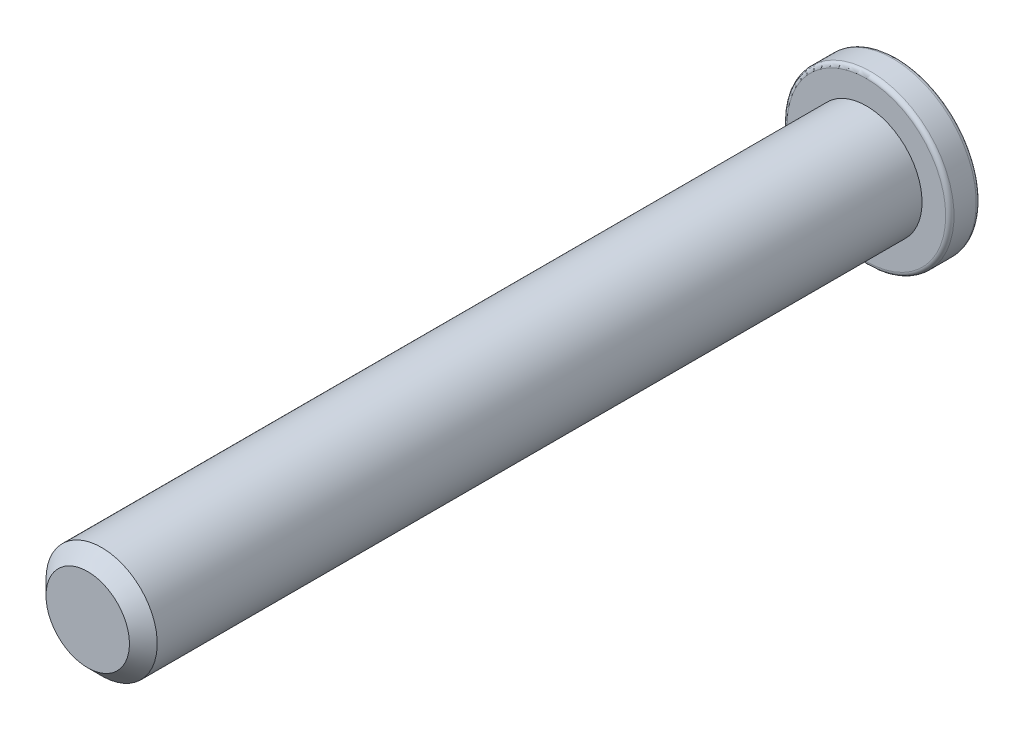
ISO-10303-21;
HEADER;
FILE_DESCRIPTION(('STEP AP214'),'2;1');
FILE_NAME('part.step','',(''),(''),'','','');
FILE_SCHEMA(('AUTOMOTIVE_DESIGN { 1 0 10303 214 1 1 1 1 }'));
ENDSEC;
DATA;
#1=APPLICATION_CONTEXT('core data for automotive mechanical design processes');
#2=APPLICATION_PROTOCOL_DEFINITION('international standard','automotive_design',2000,#1);
#3=PRODUCT_CONTEXT('',#1,'mechanical');
#4=PRODUCT('Part','Part','',(#3));
#5=PRODUCT_RELATED_PRODUCT_CATEGORY('part','',(#4));
#6=PRODUCT_DEFINITION_FORMATION('','',#4);
#7=PRODUCT_DEFINITION_CONTEXT('part definition',#1,'design');
#8=PRODUCT_DEFINITION('design','',#6,#7);
#9=PRODUCT_DEFINITION_SHAPE('','',#8);
#10=(LENGTH_UNIT() NAMED_UNIT(*) SI_UNIT(.MILLI.,.METRE.));
#11=(NAMED_UNIT(*) PLANE_ANGLE_UNIT() SI_UNIT($,.RADIAN.));
#12=(NAMED_UNIT(*) SI_UNIT($,.STERADIAN.) SOLID_ANGLE_UNIT());
#13=UNCERTAINTY_MEASURE_WITH_UNIT(LENGTH_MEASURE(1.E-05),#10,'distance_accuracy_value','');
#14=(GEOMETRIC_REPRESENTATION_CONTEXT(3) GLOBAL_UNCERTAINTY_ASSIGNED_CONTEXT((#13)) GLOBAL_UNIT_ASSIGNED_CONTEXT((#10,
#11,#12)) REPRESENTATION_CONTEXT('',''));
#15=CARTESIAN_POINT('',(0.,0.,0.));
#16=DIRECTION('',(0.,0.,1.));
#17=DIRECTION('',(1.,0.,0.));
#18=AXIS2_PLACEMENT_3D('',#15,#16,#17);
#19=CARTESIAN_POINT('',(12.09999928,-11.25,-18.9584026755113));
#20=DIRECTION('',(-0.923879532511287,0.,-0.38268343236509));
#21=DIRECTION('',(-0.38268343236509,0.,0.923879532511287));
#22=AXIS2_PLACEMENT_3D('',#19,#20,#21);
#23=PLANE('',#22);
#24=DIRECTION('',(0.,1.,0.));
#25=VECTOR('',#24,1.);
#26=CARTESIAN_POINT('',(11.6029430051523,-11.25,-17.7584026755113));
#27=LINE('',#26,#25);
#28=CARTESIAN_POINT('',(11.6029430051523,-11.3660878256678,-17.7584026755113));
#29=VERTEX_POINT('',#28);
#30=CARTESIAN_POINT('',(11.6029430051523,-11.1339121743322,-17.7584026755113));
#31=VERTEX_POINT('',#30);
#32=EDGE_CURVE('E117',#29,#31,#27,.T.);
#33=ORIENTED_EDGE('',*,*,#32,.T.);
#34=DIRECTION('',(-0.381887326256781,-0.0644695530821724,0.921957562347547));
#35=VECTOR('',#34,1.);
#36=CARTESIAN_POINT('',(12.09999928,-11.05,-18.9584026755113));
#37=LINE('',#36,#35);
#38=CARTESIAN_POINT('',(12.09999928,-11.05,-18.9584026755113));
#39=VERTEX_POINT('',#38);
#40=EDGE_CURVE('E133',#39,#31,#37,.T.);
#41=ORIENTED_EDGE('',*,*,#40,.F.);
#42=DIRECTION('',(0.,1.,0.));
#43=VECTOR('',#42,1.);
#44=CARTESIAN_POINT('',(12.09999928,-11.25,-18.9584026755113));
#45=LINE('',#44,#43);
#46=CARTESIAN_POINT('',(12.09999928,-11.45,-18.9584026755113));
#47=VERTEX_POINT('',#46);
#48=EDGE_CURVE('E122',#39,#47,#45,.F.);
#49=ORIENTED_EDGE('',*,*,#48,.T.);
#50=DIRECTION('',(0.381887326256781,-0.0644695530821737,-0.921957562347547));
#51=VECTOR('',#50,1.);
#52=CARTESIAN_POINT('',(11.6029430051523,-11.3660878256678,-17.7584026755113));
#53=LINE('',#52,#51);
#54=EDGE_CURVE('E286',#29,#47,#53,.T.);
#55=ORIENTED_EDGE('',*,*,#54,.F.);
#56=EDGE_LOOP('',(#33,#41,#49,#55));
#57=FACE_BOUND('',#56,.T.);
#58=ADVANCED_FACE('F17',(#57),#23,.T.);
#59=CARTESIAN_POINT('',(11.24999928,-11.05,-18.9584026755113));
#60=DIRECTION('',(0.,-0.997564050259824,-0.0697564737441253));
#61=DIRECTION('',(0.,0.0697564737441253,-0.997564050259824));
#62=AXIS2_PLACEMENT_3D('',#59,#60,#61);
#63=PLANE('',#62);
#64=DIRECTION('',(1.,0.,0.));
#65=VECTOR('',#64,1.);
#66=CARTESIAN_POINT('',(11.24999928,-11.1339121743322,-17.7584026755113));
#67=LINE('',#66,#65);
#68=CARTESIAN_POINT('',(11.3660871056678,-11.1339121743322,-17.7584026755113));
#69=VERTEX_POINT('',#68);
#70=EDGE_CURVE('E135',#31,#69,#67,.F.);
#71=ORIENTED_EDGE('',*,*,#70,.T.);
#72=DIRECTION('',(-0.0695873743166642,-0.0695873743166541,0.995145815783509));
#73=VECTOR('',#72,1.);
#74=CARTESIAN_POINT('',(11.44999928,-11.05,-18.9584026755113));
#75=LINE('',#74,#73);
#76=CARTESIAN_POINT('',(11.44999928,-11.05,-18.9584026755113));
#77=VERTEX_POINT('',#76);
#78=EDGE_CURVE('E139',#77,#69,#75,.T.);
#79=ORIENTED_EDGE('',*,*,#78,.F.);
#80=DIRECTION('',(1.,0.,0.));
#81=VECTOR('',#80,1.);
#82=CARTESIAN_POINT('',(11.24999928,-11.05,-18.9584026755113));
#83=LINE('',#82,#81);
#84=EDGE_CURVE('E126',#77,#39,#83,.T.);
#85=ORIENTED_EDGE('',*,*,#84,.T.);
#86=ORIENTED_EDGE('',*,*,#40,.T.);
#87=EDGE_LOOP('',(#71,#79,#85,#86));
#88=FACE_BOUND('',#87,.T.);
#89=ADVANCED_FACE('F137',(#88),#63,.T.);
#90=CARTESIAN_POINT('',(11.24999928,-11.45,-18.9584026755113));
#91=DIRECTION('',(0.,0.997564050259824,-0.0697564737441253));
#92=DIRECTION('',(0.,0.0697564737441253,0.997564050259824));
#93=AXIS2_PLACEMENT_3D('',#90,#91,#92);
#94=PLANE('',#93);
#95=DIRECTION('',(1.,0.,0.));
#96=VECTOR('',#95,1.);
#97=CARTESIAN_POINT('',(11.24999928,-11.3660878256678,-17.7584026755113));
#98=LINE('',#97,#96);
#99=CARTESIAN_POINT('',(11.3660871056678,-11.3660878256678,-17.7584026755113));
#100=VERTEX_POINT('',#99);
#101=EDGE_CURVE('E288',#100,#29,#98,.T.);
#102=ORIENTED_EDGE('',*,*,#101,.T.);
#103=ORIENTED_EDGE('',*,*,#54,.T.);
#104=DIRECTION('',(1.,0.,0.));
#105=VECTOR('',#104,1.);
#106=CARTESIAN_POINT('',(11.24999928,-11.45,-18.9584026755113));
#107=LINE('',#106,#105);
#108=CARTESIAN_POINT('',(11.44999928,-11.45,-18.9584026755113));
#109=VERTEX_POINT('',#108);
#110=EDGE_CURVE('E129',#47,#109,#107,.F.);
#111=ORIENTED_EDGE('',*,*,#110,.T.);
#112=DIRECTION('',(0.0695873743166642,-0.0695873743166541,-0.995145815783509));
#113=VECTOR('',#112,1.);
#114=CARTESIAN_POINT('',(11.3660871056678,-11.3660878256678,-17.7584026755113));
#115=LINE('',#114,#113);
#116=EDGE_CURVE('E272',#100,#109,#115,.T.);
#117=ORIENTED_EDGE('',*,*,#116,.F.);
#118=EDGE_LOOP('',(#102,#103,#111,#117));
#119=FACE_BOUND('',#118,.T.);
#120=ADVANCED_FACE('F459',(#119),#94,.T.);
#121=CARTESIAN_POINT('',(11.44999928,-11.25,-18.9584026755113));
#122=DIRECTION('',(-0.997564050259824,0.,-0.0697564737441253));
#123=DIRECTION('',(-0.0697564737441253,0.,0.997564050259824));
#124=AXIS2_PLACEMENT_3D('',#121,#122,#123);
#125=PLANE('',#124);
#126=DIRECTION('',(0.,1.,0.));
#127=VECTOR('',#126,1.);
#128=CARTESIAN_POINT('',(11.3660871056678,-11.25,-17.7584026755113));
#129=LINE('',#128,#127);
#130=CARTESIAN_POINT('',(11.3660871056678,-10.8970562748477,-17.7584026755113));
#131=VERTEX_POINT('',#130);
#132=EDGE_CURVE('E281',#69,#131,#129,.T.);
#133=ORIENTED_EDGE('',*,*,#132,.T.);
#134=DIRECTION('',(-0.0644695530821645,-0.381887326256792,0.921957562347544));
#135=VECTOR('',#134,1.);
#136=CARTESIAN_POINT('',(11.44999928,-10.4,-18.9584026755113));
#137=LINE('',#136,#135);
#138=CARTESIAN_POINT('',(11.44999928,-10.4,-18.9584026755113));
#139=VERTEX_POINT('',#138);
#140=EDGE_CURVE('E266',#139,#131,#137,.T.);
#141=ORIENTED_EDGE('',*,*,#140,.F.);
#142=DIRECTION('',(0.,1.,0.));
#143=VECTOR('',#142,1.);
#144=CARTESIAN_POINT('',(11.44999928,-11.25,-18.9584026755113));
#145=LINE('',#144,#143);
#146=EDGE_CURVE('E284',#139,#77,#145,.F.);
#147=ORIENTED_EDGE('',*,*,#146,.T.);
#148=ORIENTED_EDGE('',*,*,#78,.T.);
#149=EDGE_LOOP('',(#133,#141,#147,#148));
#150=FACE_BOUND('',#149,.T.);
#151=ADVANCED_FACE('F298',(#150),#125,.T.);
#152=CARTESIAN_POINT('',(11.44999928,-11.25,-18.9584026755113));
#153=DIRECTION('',(-0.997564050259824,0.,-0.0697564737441253));
#154=DIRECTION('',(-0.0697564737441253,0.,0.997564050259824));
#155=AXIS2_PLACEMENT_3D('',#152,#153,#154);
#156=PLANE('',#155);
#157=DIRECTION('',(0.,1.,0.));
#158=VECTOR('',#157,1.);
#159=CARTESIAN_POINT('',(11.3660871056678,-11.25,-17.7584026755113));
#160=LINE('',#159,#158);
#161=CARTESIAN_POINT('',(11.3660871056678,-11.6029437251523,-17.7584026755113));
#162=VERTEX_POINT('',#161);
#163=EDGE_CURVE('E275',#162,#100,#160,.T.);
#164=ORIENTED_EDGE('',*,*,#163,.T.);
#165=ORIENTED_EDGE('',*,*,#116,.T.);
#166=DIRECTION('',(0.,1.,0.));
#167=VECTOR('',#166,1.);
#168=CARTESIAN_POINT('',(11.44999928,-11.25,-18.9584026755113));
#169=LINE('',#168,#167);
#170=CARTESIAN_POINT('',(11.44999928,-12.1,-18.9584026755113));
#171=VERTEX_POINT('',#170);
#172=EDGE_CURVE('E278',#109,#171,#169,.F.);
#173=ORIENTED_EDGE('',*,*,#172,.T.);
#174=DIRECTION('',(0.0644695530821645,-0.381887326256792,-0.921957562347544));
#175=VECTOR('',#174,1.);
#176=CARTESIAN_POINT('',(11.3660871056678,-11.6029437251523,-17.7584026755113));
#177=LINE('',#176,#175);
#178=EDGE_CURVE('E255',#162,#171,#177,.T.);
#179=ORIENTED_EDGE('',*,*,#178,.F.);
#180=EDGE_LOOP('',(#164,#165,#173,#179));
#181=FACE_BOUND('',#180,.T.);
#182=ADVANCED_FACE('F445',(#181),#156,.T.);
#183=CARTESIAN_POINT('',(11.24999928,-10.4,-18.9584026755113));
#184=DIRECTION('',(0.,-0.923879532511287,-0.38268343236509));
#185=DIRECTION('',(0.,0.38268343236509,-0.923879532511287));
#186=AXIS2_PLACEMENT_3D('',#183,#184,#185);
#187=PLANE('',#186);
#188=DIRECTION('',(1.,0.,0.));
#189=VECTOR('',#188,1.);
#190=CARTESIAN_POINT('',(11.24999928,-10.8970562748477,-17.7584026755113));
#191=LINE('',#190,#189);
#192=CARTESIAN_POINT('',(11.1339114543322,-10.8970562748477,-17.7584026755113));
#193=VERTEX_POINT('',#192);
#194=EDGE_CURVE('E264',#131,#193,#191,.F.);
#195=ORIENTED_EDGE('',*,*,#194,.T.);
#196=DIRECTION('',(0.0644695530821724,-0.381887326256779,0.921957562347548));
#197=VECTOR('',#196,1.);
#198=CARTESIAN_POINT('',(11.04999928,-10.4,-18.9584026755113));
#199=LINE('',#198,#197);
#200=CARTESIAN_POINT('',(11.04999928,-10.4,-18.9584026755113));
#201=VERTEX_POINT('',#200);
#202=EDGE_CURVE('E249',#201,#193,#199,.T.);
#203=ORIENTED_EDGE('',*,*,#202,.F.);
#204=DIRECTION('',(1.,0.,0.));
#205=VECTOR('',#204,1.);
#206=CARTESIAN_POINT('',(11.24999928,-10.4,-18.9584026755113));
#207=LINE('',#206,#205);
#208=EDGE_CURVE('E269',#201,#139,#207,.T.);
#209=ORIENTED_EDGE('',*,*,#208,.T.);
#210=ORIENTED_EDGE('',*,*,#140,.T.);
#211=EDGE_LOOP('',(#195,#203,#209,#210));
#212=FACE_BOUND('',#211,.T.);
#213=ADVANCED_FACE('F302',(#212),#187,.T.);
#214=CARTESIAN_POINT('',(11.24999928,-12.1,-18.9584026755113));
#215=DIRECTION('',(0.,0.923879532511287,-0.38268343236509));
#216=DIRECTION('',(0.,0.38268343236509,0.923879532511287));
#217=AXIS2_PLACEMENT_3D('',#214,#215,#216);
#218=PLANE('',#217);
#219=DIRECTION('',(1.,0.,0.));
#220=VECTOR('',#219,1.);
#221=CARTESIAN_POINT('',(11.24999928,-11.6029437251523,-17.7584026755113));
#222=LINE('',#221,#220);
#223=CARTESIAN_POINT('',(11.1339114543322,-11.6029437251523,-17.7584026755113));
#224=VERTEX_POINT('',#223);
#225=EDGE_CURVE('E258',#224,#162,#222,.T.);
#226=ORIENTED_EDGE('',*,*,#225,.T.);
#227=ORIENTED_EDGE('',*,*,#178,.T.);
#228=DIRECTION('',(1.,0.,0.));
#229=VECTOR('',#228,1.);
#230=CARTESIAN_POINT('',(11.24999928,-12.1,-18.9584026755113));
#231=LINE('',#230,#229);
#232=CARTESIAN_POINT('',(11.04999928,-12.1,-18.9584026755113));
#233=VERTEX_POINT('',#232);
#234=EDGE_CURVE('E261',#171,#233,#231,.F.);
#235=ORIENTED_EDGE('',*,*,#234,.T.);
#236=DIRECTION('',(-0.0644695530821738,-0.38188732625678,-0.921957562347548));
#237=VECTOR('',#236,1.);
#238=CARTESIAN_POINT('',(11.1339114543322,-11.6029437251523,-17.7584026755113));
#239=LINE('',#238,#237);
#240=EDGE_CURVE('E241',#224,#233,#239,.T.);
#241=ORIENTED_EDGE('',*,*,#240,.F.);
#242=EDGE_LOOP('',(#226,#227,#235,#241));
#243=FACE_BOUND('',#242,.T.);
#244=ADVANCED_FACE('F431',(#243),#218,.T.);
#245=CARTESIAN_POINT('',(11.04999928,-11.25,-18.9584026755113));
#246=DIRECTION('',(0.997564050259824,0.,-0.0697564737441253));
#247=DIRECTION('',(-0.0697564737441253,0.,-0.997564050259824));
#248=AXIS2_PLACEMENT_3D('',#245,#246,#247);
#249=PLANE('',#248);
#250=DIRECTION('',(0.,1.,0.));
#251=VECTOR('',#250,1.);
#252=CARTESIAN_POINT('',(11.1339114543322,-11.25,-17.7584026755113));
#253=LINE('',#252,#251);
#254=CARTESIAN_POINT('',(11.1339114543322,-11.1339121743322,-17.7584026755113));
#255=VERTEX_POINT('',#254);
#256=EDGE_CURVE('E247',#193,#255,#253,.F.);
#257=ORIENTED_EDGE('',*,*,#256,.T.);
#258=DIRECTION('',(0.0695873743166541,-0.0695873743166642,0.995145815783509));
#259=VECTOR('',#258,1.);
#260=CARTESIAN_POINT('',(11.04999928,-11.05,-18.9584026755113));
#261=LINE('',#260,#259);
#262=CARTESIAN_POINT('',(11.04999928,-11.05,-18.9584026755113));
#263=VERTEX_POINT('',#262);
#264=EDGE_CURVE('E235',#263,#255,#261,.T.);
#265=ORIENTED_EDGE('',*,*,#264,.F.);
#266=DIRECTION('',(0.,1.,0.));
#267=VECTOR('',#266,1.);
#268=CARTESIAN_POINT('',(11.04999928,-11.25,-18.9584026755113));
#269=LINE('',#268,#267);
#270=EDGE_CURVE('E252',#263,#201,#269,.T.);
#271=ORIENTED_EDGE('',*,*,#270,.T.);
#272=ORIENTED_EDGE('',*,*,#202,.T.);
#273=EDGE_LOOP('',(#257,#265,#271,#272));
#274=FACE_BOUND('',#273,.T.);
#275=ADVANCED_FACE('F304',(#274),#249,.T.);
#276=CARTESIAN_POINT('',(11.04999928,-11.25,-18.9584026755113));
#277=DIRECTION('',(0.997564050259824,0.,-0.0697564737441253));
#278=DIRECTION('',(-0.0697564737441253,0.,-0.997564050259824));
#279=AXIS2_PLACEMENT_3D('',#276,#277,#278);
#280=PLANE('',#279);
#281=DIRECTION('',(0.,1.,0.));
#282=VECTOR('',#281,1.);
#283=CARTESIAN_POINT('',(11.1339114543322,-11.25,-17.7584026755113));
#284=LINE('',#283,#282);
#285=CARTESIAN_POINT('',(11.1339114543322,-11.3660878256678,-17.7584026755113));
#286=VERTEX_POINT('',#285);
#287=EDGE_CURVE('E230',#224,#286,#284,.T.);
#288=ORIENTED_EDGE('',*,*,#287,.F.);
#289=ORIENTED_EDGE('',*,*,#240,.T.);
#290=DIRECTION('',(0.,1.,0.));
#291=VECTOR('',#290,1.);
#292=CARTESIAN_POINT('',(11.04999928,-11.25,-18.9584026755113));
#293=LINE('',#292,#291);
#294=CARTESIAN_POINT('',(11.04999928,-11.45,-18.9584026755113));
#295=VERTEX_POINT('',#294);
#296=EDGE_CURVE('E244',#233,#295,#293,.T.);
#297=ORIENTED_EDGE('',*,*,#296,.T.);
#298=DIRECTION('',(-0.0695873743166541,-0.0695873743166642,-0.995145815783509));
#299=VECTOR('',#298,1.);
#300=CARTESIAN_POINT('',(11.1339114543322,-11.3660878256678,-17.7584026755113));
#301=LINE('',#300,#299);
#302=EDGE_CURVE('E222',#286,#295,#301,.T.);
#303=ORIENTED_EDGE('',*,*,#302,.F.);
#304=EDGE_LOOP('',(#288,#289,#297,#303));
#305=FACE_BOUND('',#304,.T.);
#306=ADVANCED_FACE('F417',(#305),#280,.T.);
#307=CARTESIAN_POINT('',(11.24999928,-11.05,-18.9584026755113));
#308=DIRECTION('',(0.,-0.997564050259824,-0.0697564737441253));
#309=DIRECTION('',(0.,0.0697564737441253,-0.997564050259824));
#310=AXIS2_PLACEMENT_3D('',#307,#308,#309);
#311=PLANE('',#310);
#312=DIRECTION('',(-1.,0.,0.));
#313=VECTOR('',#312,1.);
#314=CARTESIAN_POINT('',(11.24999928,-11.1339121743322,-17.7584026755113));
#315=LINE('',#314,#313);
#316=CARTESIAN_POINT('',(10.8970555548477,-11.1339121743322,-17.7584026755113));
#317=VERTEX_POINT('',#316);
#318=EDGE_CURVE('E232',#317,#255,#315,.F.);
#319=ORIENTED_EDGE('',*,*,#318,.F.);
#320=DIRECTION('',(0.381887326256791,-0.0644695530821644,0.921957562347544));
#321=VECTOR('',#320,1.);
#322=CARTESIAN_POINT('',(10.39999928,-11.05,-18.9584026755113));
#323=LINE('',#322,#321);
#324=CARTESIAN_POINT('',(10.39999928,-11.05,-18.9584026755113));
#325=VERTEX_POINT('',#324);
#326=EDGE_CURVE('E219',#325,#317,#323,.T.);
#327=ORIENTED_EDGE('',*,*,#326,.F.);
#328=DIRECTION('',(1.,0.,0.));
#329=VECTOR('',#328,1.);
#330=CARTESIAN_POINT('',(11.24999928,-11.05,-18.9584026755113));
#331=LINE('',#330,#329);
#332=EDGE_CURVE('E238',#325,#263,#331,.T.);
#333=ORIENTED_EDGE('',*,*,#332,.T.);
#334=ORIENTED_EDGE('',*,*,#264,.T.);
#335=EDGE_LOOP('',(#319,#327,#333,#334));
#336=FACE_BOUND('',#335,.T.);
#337=ADVANCED_FACE('F307',(#336),#311,.T.);
#338=CARTESIAN_POINT('',(11.24999928,-11.25,-17.7584026755113));
#339=DIRECTION('',(0.,0.,-1.));
#340=DIRECTION('',(-1.,0.,0.));
#341=AXIS2_PLACEMENT_3D('',#338,#339,#340);
#342=PLANE('',#341);
#343=ORIENTED_EDGE('',*,*,#225,.F.);
#344=ORIENTED_EDGE('',*,*,#287,.T.);
#345=DIRECTION('',(1.,0.,0.));
#346=VECTOR('',#345,1.);
#347=CARTESIAN_POINT('',(11.24999928,-11.3660878256678,-17.7584026755113));
#348=LINE('',#347,#346);
#349=CARTESIAN_POINT('',(10.8970555548477,-11.3660878256678,-17.7584026755113));
#350=VERTEX_POINT('',#349);
#351=EDGE_CURVE('E225',#350,#286,#348,.T.);
#352=ORIENTED_EDGE('',*,*,#351,.F.);
#353=DIRECTION('',(0.,1.,0.));
#354=VECTOR('',#353,1.);
#355=CARTESIAN_POINT('',(10.8970555548477,-11.25,-17.7584026755113));
#356=LINE('',#355,#354);
#357=EDGE_CURVE('E216',#317,#350,#356,.F.);
#358=ORIENTED_EDGE('',*,*,#357,.F.);
#359=ORIENTED_EDGE('',*,*,#318,.T.);
#360=ORIENTED_EDGE('',*,*,#256,.F.);
#361=ORIENTED_EDGE('',*,*,#194,.F.);
#362=ORIENTED_EDGE('',*,*,#132,.F.);
#363=ORIENTED_EDGE('',*,*,#70,.F.);
#364=ORIENTED_EDGE('',*,*,#32,.F.);
#365=ORIENTED_EDGE('',*,*,#101,.F.);
#366=ORIENTED_EDGE('',*,*,#163,.F.);
#367=EDGE_LOOP('',(#343,#344,#352,#358,#359,#360,#361,#362,#363,#364,#365,#366));
#368=FACE_BOUND('',#367,.T.);
#369=ADVANCED_FACE('F294',(#368),#342,.T.);
#370=CARTESIAN_POINT('',(11.24999928,-11.45,-18.9584026755113));
#371=DIRECTION('',(0.,0.997564050259824,-0.0697564737441253));
#372=DIRECTION('',(0.,0.0697564737441253,0.997564050259824));
#373=AXIS2_PLACEMENT_3D('',#370,#371,#372);
#374=PLANE('',#373);
#375=ORIENTED_EDGE('',*,*,#351,.T.);
#376=ORIENTED_EDGE('',*,*,#302,.T.);
#377=DIRECTION('',(1.,0.,0.));
#378=VECTOR('',#377,1.);
#379=CARTESIAN_POINT('',(11.24999928,-11.45,-18.9584026755113));
#380=LINE('',#379,#378);
#381=CARTESIAN_POINT('',(10.39999928,-11.45,-18.9584026755113));
#382=VERTEX_POINT('',#381);
#383=EDGE_CURVE('E228',#295,#382,#380,.F.);
#384=ORIENTED_EDGE('',*,*,#383,.T.);
#385=DIRECTION('',(-0.381887326256791,-0.0644695530821644,-0.921957562347544));
#386=VECTOR('',#385,1.);
#387=CARTESIAN_POINT('',(10.8970555548477,-11.3660878256678,-17.7584026755113));
#388=LINE('',#387,#386);
#389=EDGE_CURVE('E207',#350,#382,#388,.T.);
#390=ORIENTED_EDGE('',*,*,#389,.F.);
#391=EDGE_LOOP('',(#375,#376,#384,#390));
#392=FACE_BOUND('',#391,.T.);
#393=ADVANCED_FACE('F336',(#392),#374,.T.);
#394=CARTESIAN_POINT('',(10.39999928,-11.25,-18.9584026755113));
#395=DIRECTION('',(0.923879532511287,0.,-0.38268343236509));
#396=DIRECTION('',(-0.38268343236509,0.,-0.923879532511287));
#397=AXIS2_PLACEMENT_3D('',#394,#395,#396);
#398=PLANE('',#397);
#399=ORIENTED_EDGE('',*,*,#357,.T.);
#400=ORIENTED_EDGE('',*,*,#389,.T.);
#401=DIRECTION('',(0.,1.,0.));
#402=VECTOR('',#401,1.);
#403=CARTESIAN_POINT('',(10.39999928,-11.25,-18.9584026755113));
#404=LINE('',#403,#402);
#405=EDGE_CURVE('E215',#382,#325,#404,.T.);
#406=ORIENTED_EDGE('',*,*,#405,.T.);
#407=ORIENTED_EDGE('',*,*,#326,.T.);
#408=EDGE_LOOP('',(#399,#400,#406,#407));
#409=FACE_BOUND('',#408,.T.);
#410=ADVANCED_FACE('F331',(#409),#398,.T.);
#411=CARTESIAN_POINT('',(11.24999928,-11.25,-18.9584026755113));
#412=DIRECTION('',(0.,0.,1.));
#413=DIRECTION('',(1.,0.,0.));
#414=AXIS2_PLACEMENT_3D('',#411,#412,#413);
#415=PLANE('',#414);
#416=ORIENTED_EDGE('',*,*,#383,.F.);
#417=ORIENTED_EDGE('',*,*,#296,.F.);
#418=ORIENTED_EDGE('',*,*,#234,.F.);
#419=ORIENTED_EDGE('',*,*,#172,.F.);
#420=ORIENTED_EDGE('',*,*,#110,.F.);
#421=ORIENTED_EDGE('',*,*,#48,.F.);
#422=ORIENTED_EDGE('',*,*,#84,.F.);
#423=ORIENTED_EDGE('',*,*,#146,.F.);
#424=ORIENTED_EDGE('',*,*,#208,.F.);
#425=ORIENTED_EDGE('',*,*,#270,.F.);
#426=ORIENTED_EDGE('',*,*,#332,.F.);
#427=ORIENTED_EDGE('',*,*,#405,.F.);
#428=EDGE_LOOP('',(#416,#417,#418,#419,#420,#421,#422,#423,#424,#425,#426,#427));
#429=FACE_BOUND('',#428,.T.);
#430=CARTESIAN_POINT('',(11.24999928,-11.25,-18.9584026755113));
#431=DIRECTION('',(0.,0.,1.));
#432=DIRECTION('',(-1.,0.,0.));
#433=AXIS2_PLACEMENT_3D('',#430,#431,#432);
#434=CIRCLE('',#433,1.42499999999999);
#435=CARTESIAN_POINT('',(9.82499928000001,-11.25,-18.9584026755113));
#436=VERTEX_POINT('',#435);
#437=CARTESIAN_POINT('',(12.67499928,-11.25,-18.9584026755113));
#438=VERTEX_POINT('',#437);
#439=EDGE_CURVE('E311',#436,#438,#434,.T.);
#440=ORIENTED_EDGE('',*,*,#439,.F.);
#441=CARTESIAN_POINT('',(11.24999928,-11.25,-18.9584026755113));
#442=DIRECTION('',(0.,0.,1.));
#443=DIRECTION('',(1.,0.,0.));
#444=AXIS2_PLACEMENT_3D('',#441,#442,#443);
#445=CIRCLE('',#444,1.425);
#446=EDGE_CURVE('E187',#438,#436,#445,.T.);
#447=ORIENTED_EDGE('',*,*,#446,.F.);
#448=EDGE_LOOP('',(#440,#447));
#449=FACE_BOUND('',#448,.T.);
#450=ADVANCED_FACE('F123',(#429,#449),#415,.F.);
#451=CARTESIAN_POINT('',(11.24999928,-11.25,-18.8834026755113));
#452=DIRECTION('',(0.,0.,1.));
#453=DIRECTION('',(-1.,0.,0.));
#454=AXIS2_PLACEMENT_3D('',#451,#452,#453);
#455=TOROIDAL_SURFACE('',#454,1.425,0.075);
#456=CARTESIAN_POINT('',(11.24999928,-11.25,-18.8834026755113));
#457=DIRECTION('',(0.,0.,-1.));
#458=DIRECTION('',(-1.,0.,0.));
#459=AXIS2_PLACEMENT_3D('',#456,#457,#458);
#460=CIRCLE('',#459,1.5);
#461=CARTESIAN_POINT('',(9.74999928,-11.25,-18.8834026755113));
#462=VERTEX_POINT('',#461);
#463=EDGE_CURVE('E184',#462,#462,#460,.F.);
#464=ORIENTED_EDGE('',*,*,#463,.F.);
#465=EDGE_LOOP('',(#464));
#466=FACE_BOUND('',#465,.T.);
#467=ORIENTED_EDGE('',*,*,#446,.T.);
#468=ORIENTED_EDGE('',*,*,#439,.T.);
#469=EDGE_LOOP('',(#467,#468));
#470=FACE_BOUND('',#469,.T.);
#471=ADVANCED_FACE('F191',(#466,#470),#455,.T.);
#472=CARTESIAN_POINT('',(11.24999928,-11.25,-18.4084026755113));
#473=DIRECTION('',(0.,0.,-1.));
#474=DIRECTION('',(-1.,0.,0.));
#475=AXIS2_PLACEMENT_3D('',#472,#473,#474);
#476=CYLINDRICAL_SURFACE('',#475,1.5);
#477=ORIENTED_EDGE('',*,*,#463,.T.);
#478=EDGE_LOOP('',(#477));
#479=FACE_BOUND('',#478,.T.);
#480=CARTESIAN_POINT('',(11.24999928,-11.25,-18.4834026755113));
#481=DIRECTION('',(0.,0.,1.));
#482=DIRECTION('',(-1.,0.,0.));
#483=AXIS2_PLACEMENT_3D('',#480,#481,#482);
#484=CIRCLE('',#483,1.5);
#485=CARTESIAN_POINT('',(9.74999928,-11.25,-18.4834026755113));
#486=VERTEX_POINT('',#485);
#487=EDGE_CURVE('E149',#486,#486,#484,.T.);
#488=ORIENTED_EDGE('',*,*,#487,.F.);
#489=EDGE_LOOP('',(#488));
#490=FACE_BOUND('',#489,.T.);
#491=ADVANCED_FACE('F195',(#479,#490),#476,.T.);
#492=CARTESIAN_POINT('',(11.24999928,-11.25,-4.40840267551127));
#493=DIRECTION('',(0.,0.,1.));
#494=DIRECTION('',(1.,0.,0.));
#495=AXIS2_PLACEMENT_3D('',#492,#493,#494);
#496=PLANE('',#495);
#497=CARTESIAN_POINT('',(11.24999928,-11.25,-4.40840267549447));
#498=DIRECTION('',(0.,0.,-1.));
#499=DIRECTION('',(-1.,0.,0.));
#500=AXIS2_PLACEMENT_3D('',#497,#498,#499);
#501=CIRCLE('',#500,0.749999999964867);
#502=CARTESIAN_POINT('',(10.4999992800351,-11.25,-4.40840267549447));
#503=VERTEX_POINT('',#502);
#504=EDGE_CURVE('E145',#503,#503,#501,.T.);
#505=ORIENTED_EDGE('',*,*,#504,.F.);
#506=EDGE_LOOP('',(#505));
#507=FACE_BOUND('',#506,.T.);
#508=ADVANCED_FACE('F166',(#507),#496,.T.);
#509=CARTESIAN_POINT('',(11.24999928,-11.25,-18.4834026755113));
#510=DIRECTION('',(0.,0.,1.));
#511=DIRECTION('',(-1.,0.,0.));
#512=AXIS2_PLACEMENT_3D('',#509,#510,#511);
#513=TOROIDAL_SURFACE('',#512,1.425,0.075);
#514=CARTESIAN_POINT('',(11.24999928,-11.25,-18.4084026755113));
#515=DIRECTION('',(0.,0.,-1.));
#516=DIRECTION('',(1.,0.,0.));
#517=AXIS2_PLACEMENT_3D('',#514,#515,#516);
#518=CIRCLE('',#517,1.425);
#519=CARTESIAN_POINT('',(9.82499928000001,-11.25,-18.4084026755113));
#520=VERTEX_POINT('',#519);
#521=CARTESIAN_POINT('',(12.67499928,-11.25,-18.4084026755113));
#522=VERTEX_POINT('',#521);
#523=EDGE_CURVE('E148',#520,#522,#518,.F.);
#524=ORIENTED_EDGE('',*,*,#523,.F.);
#525=CARTESIAN_POINT('',(11.24999928,-11.25,-18.4084026755113));
#526=DIRECTION('',(0.,0.,-1.));
#527=DIRECTION('',(-1.,0.,0.));
#528=AXIS2_PLACEMENT_3D('',#525,#526,#527);
#529=CIRCLE('',#528,1.425);
#530=EDGE_CURVE('E36',#522,#520,#529,.F.);
#531=ORIENTED_EDGE('',*,*,#530,.F.);
#532=EDGE_LOOP('',(#524,#531));
#533=FACE_BOUND('',#532,.T.);
#534=ORIENTED_EDGE('',*,*,#487,.T.);
#535=EDGE_LOOP('',(#534));
#536=FACE_BOUND('',#535,.T.);
#537=ADVANCED_FACE('F154',(#533,#536),#513,.T.);
#538=CARTESIAN_POINT('',(11.24999928,-11.25,-4.65840267577278));
#539=DIRECTION('',(0.,0.,-1.));
#540=DIRECTION('',(-1.,0.,0.));
#541=AXIS2_PLACEMENT_3D('',#538,#539,#540);
#542=CONICAL_SURFACE('',#541,0.999999999788425,0.785398162487954);
#543=ORIENTED_EDGE('',*,*,#504,.T.);
#544=EDGE_LOOP('',(#543));
#545=FACE_BOUND('',#544,.T.);
#546=CARTESIAN_POINT('',(11.24999928,-11.25,-4.65840267551127));
#547=DIRECTION('',(0.,0.,-1.));
#548=DIRECTION('',(-1.,0.,0.));
#549=AXIS2_PLACEMENT_3D('',#546,#547,#548);
#550=CIRCLE('',#549,1.);
#551=CARTESIAN_POINT('',(10.24999928,-11.25,-4.65840267551127));
#552=VERTEX_POINT('',#551);
#553=EDGE_CURVE('E28',#552,#552,#550,.T.);
#554=ORIENTED_EDGE('',*,*,#553,.F.);
#555=EDGE_LOOP('',(#554));
#556=FACE_BOUND('',#555,.T.);
#557=ADVANCED_FACE('F165',(#545,#556),#542,.T.);
#558=CARTESIAN_POINT('',(11.24999928,-11.25,-18.4084026755113));
#559=DIRECTION('',(0.,0.,1.));
#560=DIRECTION('',(1.,0.,0.));
#561=AXIS2_PLACEMENT_3D('',#558,#559,#560);
#562=PLANE('',#561);
#563=CARTESIAN_POINT('',(11.24999928,-11.25,-18.4084026755113));
#564=DIRECTION('',(0.,0.,-1.));
#565=DIRECTION('',(-1.,0.,0.));
#566=AXIS2_PLACEMENT_3D('',#563,#564,#565);
#567=CIRCLE('',#566,1.);
#568=CARTESIAN_POINT('',(10.24999928,-11.25,-18.4084026755113));
#569=VERTEX_POINT('',#568);
#570=EDGE_CURVE('E11',#569,#569,#567,.F.);
#571=ORIENTED_EDGE('',*,*,#570,.F.);
#572=EDGE_LOOP('',(#571));
#573=FACE_BOUND('',#572,.T.);
#574=ORIENTED_EDGE('',*,*,#523,.T.);
#575=ORIENTED_EDGE('',*,*,#530,.T.);
#576=EDGE_LOOP('',(#574,#575));
#577=FACE_BOUND('',#576,.T.);
#578=ADVANCED_FACE('F339',(#573,#577),#562,.T.);
#579=CARTESIAN_POINT('',(11.24999928,-11.25,-4.40840267551127));
#580=DIRECTION('',(0.,0.,-1.));
#581=DIRECTION('',(-1.,0.,0.));
#582=AXIS2_PLACEMENT_3D('',#579,#580,#581);
#583=CYLINDRICAL_SURFACE('',#582,1.);
#584=ORIENTED_EDGE('',*,*,#553,.T.);
#585=EDGE_LOOP('',(#584));
#586=FACE_BOUND('',#585,.T.);
#587=ORIENTED_EDGE('',*,*,#570,.T.);
#588=EDGE_LOOP('',(#587));
#589=FACE_BOUND('',#588,.T.);
#590=ADVANCED_FACE('F337',(#586,#589),#583,.T.);
#591=CLOSED_SHELL('',(#58,#89,#120,#151,#182,#213,#244,#275,#306,#337,#369,#393,#410,#450,#471,
#491,#508,#537,#557,#578,#590));
#592=MANIFOLD_SOLID_BREP('B1',#591);
#593=ADVANCED_BREP_SHAPE_REPRESENTATION('',(#18,#592),#14);
#594=SHAPE_DEFINITION_REPRESENTATION(#9,#593);
ENDSEC;
END-ISO-10303-21;
